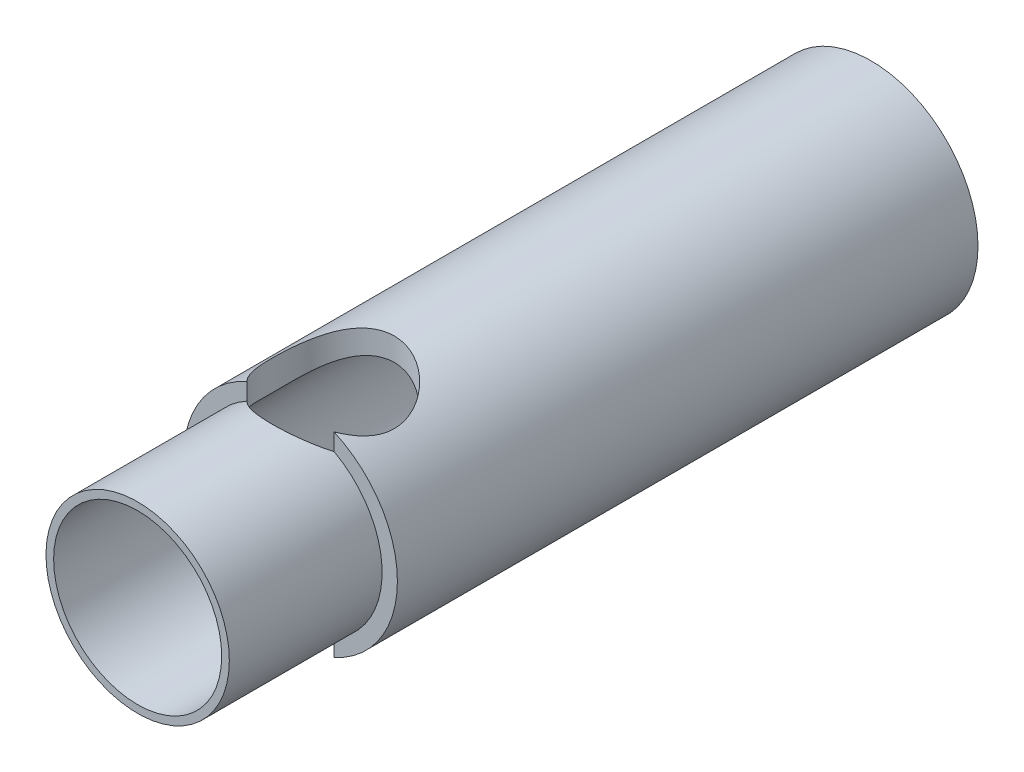
ISO-10303-21;
HEADER;
FILE_DESCRIPTION(('STEP AP214'),'2;1');
FILE_NAME('part.step','',(''),(''),'','','');
FILE_SCHEMA(('AUTOMOTIVE_DESIGN { 1 0 10303 214 1 1 1 1 }'));
ENDSEC;
DATA;
#1=APPLICATION_CONTEXT('core data for automotive mechanical design processes');
#2=APPLICATION_PROTOCOL_DEFINITION('international standard','automotive_design',2000,#1);
#3=PRODUCT_CONTEXT('',#1,'mechanical');
#4=PRODUCT('Part','Part','',(#3));
#5=PRODUCT_RELATED_PRODUCT_CATEGORY('part','',(#4));
#6=PRODUCT_DEFINITION_FORMATION('','',#4);
#7=PRODUCT_DEFINITION_CONTEXT('part definition',#1,'design');
#8=PRODUCT_DEFINITION('design','',#6,#7);
#9=PRODUCT_DEFINITION_SHAPE('','',#8);
#10=(LENGTH_UNIT() NAMED_UNIT(*) SI_UNIT(.MILLI.,.METRE.));
#11=(NAMED_UNIT(*) PLANE_ANGLE_UNIT() SI_UNIT($,.RADIAN.));
#12=(NAMED_UNIT(*) SI_UNIT($,.STERADIAN.) SOLID_ANGLE_UNIT());
#13=UNCERTAINTY_MEASURE_WITH_UNIT(LENGTH_MEASURE(1.E-05),#10,'distance_accuracy_value','');
#14=(GEOMETRIC_REPRESENTATION_CONTEXT(3) GLOBAL_UNCERTAINTY_ASSIGNED_CONTEXT((#13)) GLOBAL_UNIT_ASSIGNED_CONTEXT((#10,
#11,#12)) REPRESENTATION_CONTEXT('',''));
#15=CARTESIAN_POINT('',(0.,0.,0.));
#16=DIRECTION('',(0.,0.,1.));
#17=DIRECTION('',(1.,0.,0.));
#18=AXIS2_PLACEMENT_3D('',#15,#16,#17);
#19=CARTESIAN_POINT('',(0.,0.,19.));
#20=DIRECTION('',(0.,0.,1.));
#21=DIRECTION('',(1.,0.,0.));
#22=AXIS2_PLACEMENT_3D('',#19,#20,#21);
#23=PLANE('',#22);
#24=DIRECTION('',(0.,1.,0.));
#25=VECTOR('',#24,1.);
#26=CARTESIAN_POINT('',(1.42828568570857,-3.5,19.));
#27=LINE('',#26,#25);
#28=CARTESIAN_POINT('',(1.42828568570857,-3.19530906173409,19.));
#29=VERTEX_POINT('',#28);
#30=CARTESIAN_POINT('',(1.42828568570857,-2.63818119165458,19.));
#31=VERTEX_POINT('',#30);
#32=EDGE_CURVE('E39',#29,#31,#27,.T.);
#33=ORIENTED_EDGE('',*,*,#32,.F.);
#34=CARTESIAN_POINT('',(0.,0.,19.));
#35=DIRECTION('',(0.,0.,1.));
#36=DIRECTION('',(1.,0.,0.));
#37=AXIS2_PLACEMENT_3D('',#34,#35,#36);
#38=CIRCLE('',#37,3.5);
#39=CARTESIAN_POINT('',(1.42828568570857,3.19530906173409,19.));
#40=VERTEX_POINT('',#39);
#41=EDGE_CURVE('E129',#29,#40,#38,.T.);
#42=ORIENTED_EDGE('',*,*,#41,.T.);
#43=CARTESIAN_POINT('',(1.42828568570857,2.63818119165458,19.));
#44=VERTEX_POINT('',#43);
#45=EDGE_CURVE('E120',#44,#40,#27,.T.);
#46=ORIENTED_EDGE('',*,*,#45,.F.);
#47=CARTESIAN_POINT('',(0.,0.,19.));
#48=DIRECTION('',(0.,0.,1.));
#49=DIRECTION('',(1.,0.,0.));
#50=AXIS2_PLACEMENT_3D('',#47,#48,#49);
#51=CIRCLE('',#50,3.);
#52=EDGE_CURVE('E31',#31,#44,#51,.T.);
#53=ORIENTED_EDGE('',*,*,#52,.F.);
#54=EDGE_LOOP('',(#33,#42,#46,#53));
#55=FACE_BOUND('',#54,.T.);
#56=ADVANCED_FACE('F16',(#55),#23,.T.);
#57=CARTESIAN_POINT('',(0.,0.,4.));
#58=DIRECTION('',(0.,0.,-1.));
#59=DIRECTION('',(-1.,0.,0.));
#60=AXIS2_PLACEMENT_3D('',#57,#58,#59);
#61=PLANE('',#60);
#62=CARTESIAN_POINT('',(0.,0.,4.));
#63=DIRECTION('',(0.,0.,-1.));
#64=DIRECTION('',(-1.,0.,0.));
#65=AXIS2_PLACEMENT_3D('',#62,#63,#64);
#66=CIRCLE('',#65,2.75);
#67=CARTESIAN_POINT('',(-2.38156986040721,1.375,4.));
#68=VERTEX_POINT('',#67);
#69=CARTESIAN_POINT('',(0.,2.75,4.));
#70=VERTEX_POINT('',#69);
#71=EDGE_CURVE('E321',#68,#70,#66,.T.);
#72=ORIENTED_EDGE('',*,*,#71,.F.);
#73=DIRECTION('',(0.5,0.866025403784439,0.));
#74=VECTOR('',#73,1.);
#75=CARTESIAN_POINT('',(-3.17542648054294,0.,4.));
#76=LINE('',#75,#74);
#77=CARTESIAN_POINT('',(-1.58771324027147,2.75,4.));
#78=VERTEX_POINT('',#77);
#79=EDGE_CURVE('E269',#68,#78,#76,.T.);
#80=ORIENTED_EDGE('',*,*,#79,.T.);
#81=DIRECTION('',(1.,0.,0.));
#82=VECTOR('',#81,1.);
#83=CARTESIAN_POINT('',(-1.58771324027147,2.75,4.));
#84=LINE('',#83,#82);
#85=EDGE_CURVE('E274',#78,#70,#84,.T.);
#86=ORIENTED_EDGE('',*,*,#85,.T.);
#87=EDGE_LOOP('',(#72,#80,#86));
#88=FACE_BOUND('',#87,.T.);
#89=ADVANCED_FACE('F204',(#88),#61,.T.);
#90=CARTESIAN_POINT('',(2.38156986040721,1.375,4.));
#91=VERTEX_POINT('',#90);
#92=EDGE_CURVE('E322',#70,#91,#66,.T.);
#93=ORIENTED_EDGE('',*,*,#92,.F.);
#94=CARTESIAN_POINT('',(1.58771324027147,2.75,4.));
#95=VERTEX_POINT('',#94);
#96=EDGE_CURVE('E273',#70,#95,#84,.T.);
#97=ORIENTED_EDGE('',*,*,#96,.T.);
#98=DIRECTION('',(0.5,-0.866025403784439,0.));
#99=VECTOR('',#98,1.);
#100=CARTESIAN_POINT('',(1.58771324027147,2.75,4.));
#101=LINE('',#100,#99);
#102=EDGE_CURVE('E315',#95,#91,#101,.T.);
#103=ORIENTED_EDGE('',*,*,#102,.T.);
#104=EDGE_LOOP('',(#93,#97,#103));
#105=FACE_BOUND('',#104,.T.);
#106=ADVANCED_FACE('F208',(#105),#61,.T.);
#107=CARTESIAN_POINT('',(2.38156986040721,-1.375,4.));
#108=VERTEX_POINT('',#107);
#109=EDGE_CURVE('E318',#91,#108,#66,.T.);
#110=ORIENTED_EDGE('',*,*,#109,.F.);
#111=CARTESIAN_POINT('',(3.17542648054294,0.,4.));
#112=VERTEX_POINT('',#111);
#113=EDGE_CURVE('E295',#91,#112,#101,.T.);
#114=ORIENTED_EDGE('',*,*,#113,.T.);
#115=DIRECTION('',(-0.5,-0.866025403784439,0.));
#116=VECTOR('',#115,1.);
#117=CARTESIAN_POINT('',(3.17542648054294,0.,4.));
#118=LINE('',#117,#116);
#119=EDGE_CURVE('E258',#112,#108,#118,.T.);
#120=ORIENTED_EDGE('',*,*,#119,.T.);
#121=EDGE_LOOP('',(#110,#114,#120));
#122=FACE_BOUND('',#121,.T.);
#123=ADVANCED_FACE('F214',(#122),#61,.T.);
#124=CARTESIAN_POINT('',(0.,-2.75,4.));
#125=VERTEX_POINT('',#124);
#126=EDGE_CURVE('E249',#108,#125,#66,.T.);
#127=ORIENTED_EDGE('',*,*,#126,.F.);
#128=CARTESIAN_POINT('',(1.58771324027147,-2.75,4.));
#129=VERTEX_POINT('',#128);
#130=EDGE_CURVE('E262',#108,#129,#118,.T.);
#131=ORIENTED_EDGE('',*,*,#130,.T.);
#132=DIRECTION('',(-1.,0.,0.));
#133=VECTOR('',#132,1.);
#134=CARTESIAN_POINT('',(1.58771324027147,-2.75,4.));
#135=LINE('',#134,#133);
#136=EDGE_CURVE('E256',#129,#125,#135,.T.);
#137=ORIENTED_EDGE('',*,*,#136,.T.);
#138=EDGE_LOOP('',(#127,#131,#137));
#139=FACE_BOUND('',#138,.T.);
#140=ADVANCED_FACE('F232',(#139),#61,.T.);
#141=CARTESIAN_POINT('',(-2.38156986040721,-1.375,4.));
#142=VERTEX_POINT('',#141);
#143=EDGE_CURVE('E242',#125,#142,#66,.T.);
#144=ORIENTED_EDGE('',*,*,#143,.F.);
#145=CARTESIAN_POINT('',(-1.58771324027147,-2.75,4.));
#146=VERTEX_POINT('',#145);
#147=EDGE_CURVE('E244',#125,#146,#135,.T.);
#148=ORIENTED_EDGE('',*,*,#147,.T.);
#149=DIRECTION('',(-0.5,0.866025403784439,0.));
#150=VECTOR('',#149,1.);
#151=CARTESIAN_POINT('',(-1.58771324027147,-2.75,4.));
#152=LINE('',#151,#150);
#153=EDGE_CURVE('E247',#146,#142,#152,.T.);
#154=ORIENTED_EDGE('',*,*,#153,.T.);
#155=EDGE_LOOP('',(#144,#148,#154));
#156=FACE_BOUND('',#155,.T.);
#157=ADVANCED_FACE('F221',(#156),#61,.T.);
#158=CARTESIAN_POINT('',(0.,0.,19.));
#159=DIRECTION('',(0.,0.,-1.));
#160=DIRECTION('',(-1.,0.,0.));
#161=AXIS2_PLACEMENT_3D('',#158,#159,#160);
#162=CYLINDRICAL_SURFACE('',#161,3.5);
#163=CARTESIAN_POINT('',(-1.42828568570857,3.19530906173409,19.));
#164=VERTEX_POINT('',#163);
#165=CARTESIAN_POINT('',(-1.42828568570857,-3.19530906173409,19.));
#166=VERTEX_POINT('',#165);
#167=EDGE_CURVE('E134',#164,#166,#38,.T.);
#168=ORIENTED_EDGE('',*,*,#167,.F.);
#169=CARTESIAN_POINT('',(-1.42828568570857,3.19530906173409,19.));
#170=CARTESIAN_POINT('',(-1.50540075099643,3.16088219235599,18.9212899360863));
#171=CARTESIAN_POINT('',(-1.57602687440512,3.12591402054111,18.8362557376562));
#172=CARTESIAN_POINT('',(-1.70328088219409,3.05843234688911,18.6541901318598));
#173=CARTESIAN_POINT('',(-1.75977642340309,3.02594389846291,18.5570572000863));
#174=CARTESIAN_POINT('',(-1.85649150133034,2.96760317884196,18.3525059916485));
#175=CARTESIAN_POINT('',(-1.89664389660993,2.94177843949423,18.2450474840408));
#176=CARTESIAN_POINT('',(-1.95806267846864,2.9012718661427,18.0232398700548));
#177=CARTESIAN_POINT('',(-1.97941439999871,2.88653972822981,17.9089244403634));
#178=CARTESIAN_POINT('',(-2.00049949160929,2.87195745617673,17.6916858385504));
#179=CARTESIAN_POINT('',(-2.0025751082838,2.87049543971656,17.589097274272));
#180=CARTESIAN_POINT('',(-1.99105032466949,2.878500637721,17.3851685869099));
#181=CARTESIAN_POINT('',(-1.97743821917266,2.88797601299917,17.2838294531264));
#182=CARTESIAN_POINT('',(-1.9372397850846,2.91506675548669,17.0943619692331));
#183=CARTESIAN_POINT('',(-1.91188366547716,2.93190323133123,17.0058508629221));
#184=CARTESIAN_POINT('',(-1.84987418158541,2.97141599701883,16.8343043289516));
#185=CARTESIAN_POINT('',(-1.81321892230411,2.99409326632582,16.7512698226193));
#186=CARTESIAN_POINT('',(-1.72411381616276,3.04637986157905,16.5812671627577));
#187=CARTESIAN_POINT('',(-1.67022092674974,3.0765085972055,16.4952173151997));
#188=CARTESIAN_POINT('',(-1.55044597548239,3.13857826599021,16.3325886107996));
#189=CARTESIAN_POINT('',(-1.48455368209843,3.17052072953958,16.2560179308775));
#190=CARTESIAN_POINT('',(-1.33116446713628,3.23821254238362,16.1028637841158));
#191=CARTESIAN_POINT('',(-1.24191284281847,3.27382422477775,16.0279613138386));
#192=CARTESIAN_POINT('',(-1.05049527278557,3.34016587520829,15.8941025924676));
#193=CARTESIAN_POINT('',(-0.948330663057441,3.3708963475171,15.8351446937151));
#194=CARTESIAN_POINT('',(-0.736136215932795,3.4234086325735,15.7368281129788));
#195=CARTESIAN_POINT('',(-0.626377143751666,3.4454007742097,15.6970032207837));
#196=CARTESIAN_POINT('',(-0.400133986017147,3.47892410517635,15.6369555224841));
#197=CARTESIAN_POINT('',(-0.283658246177626,3.49046799114165,15.6167089229457));
#198=CARTESIAN_POINT('',(-0.0634756279869164,3.50093500652055,15.5983544451567));
#199=CARTESIAN_POINT('',(0.0399620941799944,3.50128174850157,15.5977492835162));
#200=CARTESIAN_POINT('',(0.245317216555775,3.49290267271402,15.6124367211845));
#201=CARTESIAN_POINT('',(0.347234826363394,3.48417811768217,15.6277271078115));
#202=CARTESIAN_POINT('',(0.541933044290401,3.4591207883811,15.6723496857516));
#203=CARTESIAN_POINT('',(0.6349183573146,3.44315403218992,15.7010080466811));
#204=CARTESIAN_POINT('',(0.814671537645636,3.40510772827646,15.7708973811678));
#205=CARTESIAN_POINT('',(0.901438324431149,3.38302712144718,15.8121305331913));
#206=CARTESIAN_POINT('',(1.07408031056902,3.33243092782974,15.9097395015168));
#207=CARTESIAN_POINT('',(1.15929571756628,3.30353553741324,15.9670815684401));
#208=CARTESIAN_POINT('',(1.31943841016314,3.24290449907532,16.0935112981239));
#209=CARTESIAN_POINT('',(1.39435598338631,3.21116621584451,16.1626099134789));
#210=CARTESIAN_POINT('',(1.54144081109961,3.14345298771101,16.3205431493815));
#211=CARTESIAN_POINT('',(1.61211040714192,3.10744150402796,16.4107631416315));
#212=CARTESIAN_POINT('',(1.73752559142288,3.03909725279354,16.6029297670978));
#213=CARTESIAN_POINT('',(1.79227977495783,3.00676250534589,16.7048700289812));
#214=CARTESIAN_POINT('',(1.87624309014316,2.95495012966174,16.9006638359873));
#215=CARTESIAN_POINT('',(1.90819661642942,2.93422562195949,16.9930053285875));
#216=CARTESIAN_POINT('',(1.9584364867525,2.90093919380007,17.1827151683584));
#217=CARTESIAN_POINT('',(1.97673923709188,2.88836747722102,17.2800773303658));
#218=CARTESIAN_POINT('',(1.99874204321677,2.87319036043596,17.4777137539879));
#219=CARTESIAN_POINT('',(2.00237316416221,2.87063200991594,17.5779995379321));
#220=CARTESIAN_POINT('',(1.99459620906295,2.87603970770297,17.7776790711712));
#221=CARTESIAN_POINT('',(1.98318922714383,2.8840049903433,17.8770728848334));
#222=CARTESIAN_POINT('',(1.94735235183452,2.90830441512838,18.065144562592));
#223=CARTESIAN_POINT('',(1.92387192897381,2.92402540088592,18.1540893107039));
#224=CARTESIAN_POINT('',(1.86547084061028,2.96162506324936,18.3268796250716));
#225=CARTESIAN_POINT('',(1.83053053918116,2.98351429971253,18.4107161441941));
#226=CARTESIAN_POINT('',(1.74330319278334,3.03543675238782,18.5859360069279));
#227=CARTESIAN_POINT('',(1.68906135579018,3.06622370341073,18.6761177097515));
#228=CARTESIAN_POINT('',(1.56786092378043,3.12994099360824,18.8460488701752));
#229=CARTESIAN_POINT('',(1.5009558214801,3.16286194684341,18.9258399095379));
#230=CARTESIAN_POINT('',(1.42828568570858,3.19530906173409,19.));
#231=B_SPLINE_CURVE_WITH_KNOTS('',3,(#169,#170,#171,#172,#173,#174,#175,#176,#177,#178,#179,
#180,#181,#182,#183,#184,#185,#186,#187,#188,#189,#190,#191,#192,#193,#194,#195,#196,#197,#198,
#199,#200,#201,#202,#203,#204,#205,#206,#207,#208,#209,#210,#211,#212,#213,#214,#215,#216,#217,
#218,#219,#220,#221,#222,#223,#224,#225,#226,#227,#228,#229,#230),.UNSPECIFIED.,.F.,.F.,(4,2,2,
2,2,2,2,2,2,2,2,2,2,2,2,2,2,2,2,2,2,2,2,2,2,2,2,2,2,2,4),(0.,0.346213819330013,
0.695558032847954,1.04632328947067,1.39548811587963,1.70157290849816,2.00788623059734,
2.28758180990387,2.56732432295289,2.88384871287554,3.20064426816473,3.56440500234285,
3.92812813232727,4.2824717053999,4.63638410266836,4.94509488146347,5.25376269305672,
5.54832066534372,5.84292969609173,6.16176014847242,6.48088927144811,6.83966046648897,
7.1982375415979,7.49666339586378,7.79473000391131,8.09419546457953,8.39363913827486,
8.6724913485849,8.95182387630175,9.27945616936722,9.60573416372487),.UNSPECIFIED.);
#232=EDGE_CURVE('E130',#164,#40,#231,.T.);
#233=ORIENTED_EDGE('',*,*,#232,.T.);
#234=ORIENTED_EDGE('',*,*,#41,.F.);
#235=CARTESIAN_POINT('',(1.42828568570857,-3.19530906173409,19.));
#236=CARTESIAN_POINT('',(1.50540075099643,-3.16088219235599,18.9212899360863));
#237=CARTESIAN_POINT('',(1.57602687440512,-3.12591402054111,18.8362557376562));
#238=CARTESIAN_POINT('',(1.70328088219409,-3.05843234688911,18.6541901318598));
#239=CARTESIAN_POINT('',(1.75977642340309,-3.02594389846291,18.5570572000863));
#240=CARTESIAN_POINT('',(1.85649150133034,-2.96760317884196,18.3525059916485));
#241=CARTESIAN_POINT('',(1.89664389660993,-2.94177843949423,18.2450474840408));
#242=CARTESIAN_POINT('',(1.95806267846864,-2.9012718661427,18.0232398700548));
#243=CARTESIAN_POINT('',(1.97941439999871,-2.88653972822981,17.9089244403634));
#244=CARTESIAN_POINT('',(2.00049949160929,-2.87195745617673,17.6916858385504));
#245=CARTESIAN_POINT('',(2.0025751082838,-2.87049543971656,17.589097274272));
#246=CARTESIAN_POINT('',(1.99105032466949,-2.878500637721,17.3851685869099));
#247=CARTESIAN_POINT('',(1.97743821917266,-2.88797601299917,17.2838294531264));
#248=CARTESIAN_POINT('',(1.9372397850846,-2.91506675548669,17.0943619692331));
#249=CARTESIAN_POINT('',(1.91188366547716,-2.93190323133123,17.0058508629221));
#250=CARTESIAN_POINT('',(1.84987418158541,-2.97141599701883,16.8343043289516));
#251=CARTESIAN_POINT('',(1.81321892230411,-2.99409326632582,16.7512698226193));
#252=CARTESIAN_POINT('',(1.72411381616276,-3.04637986157905,16.5812671627577));
#253=CARTESIAN_POINT('',(1.67022092674974,-3.0765085972055,16.4952173151997));
#254=CARTESIAN_POINT('',(1.55044597548239,-3.13857826599021,16.3325886107996));
#255=CARTESIAN_POINT('',(1.48455368209843,-3.17052072953958,16.2560179308775));
#256=CARTESIAN_POINT('',(1.33116446713628,-3.23821254238362,16.1028637841158));
#257=CARTESIAN_POINT('',(1.24191284281847,-3.27382422477775,16.0279613138386));
#258=CARTESIAN_POINT('',(1.05049527278557,-3.34016587520829,15.8941025924676));
#259=CARTESIAN_POINT('',(0.948330663057441,-3.3708963475171,15.8351446937151));
#260=CARTESIAN_POINT('',(0.736136215932795,-3.4234086325735,15.7368281129788));
#261=CARTESIAN_POINT('',(0.626377143751666,-3.4454007742097,15.6970032207837));
#262=CARTESIAN_POINT('',(0.400133986017147,-3.47892410517635,15.6369555224841));
#263=CARTESIAN_POINT('',(0.283658246177626,-3.49046799114165,15.6167089229457));
#264=CARTESIAN_POINT('',(0.0634756279869164,-3.50093500652055,15.5983544451567));
#265=CARTESIAN_POINT('',(-0.0399620941799944,-3.50128174850157,15.5977492835162));
#266=CARTESIAN_POINT('',(-0.245317216555775,-3.49290267271402,15.6124367211845));
#267=CARTESIAN_POINT('',(-0.347234826363394,-3.48417811768217,15.6277271078115));
#268=CARTESIAN_POINT('',(-0.541933044290401,-3.4591207883811,15.6723496857516));
#269=CARTESIAN_POINT('',(-0.6349183573146,-3.44315403218992,15.7010080466811));
#270=CARTESIAN_POINT('',(-0.814671537645636,-3.40510772827646,15.7708973811678));
#271=CARTESIAN_POINT('',(-0.901438324431149,-3.38302712144718,15.8121305331913));
#272=CARTESIAN_POINT('',(-1.07408031056902,-3.33243092782974,15.9097395015168));
#273=CARTESIAN_POINT('',(-1.15929571756628,-3.30353553741324,15.9670815684401));
#274=CARTESIAN_POINT('',(-1.31943841016314,-3.24290449907532,16.0935112981239));
#275=CARTESIAN_POINT('',(-1.39435598338631,-3.21116621584451,16.1626099134789));
#276=CARTESIAN_POINT('',(-1.54144081109961,-3.14345298771101,16.3205431493815));
#277=CARTESIAN_POINT('',(-1.61211040714192,-3.10744150402796,16.4107631416315));
#278=CARTESIAN_POINT('',(-1.73752559142288,-3.03909725279354,16.6029297670978));
#279=CARTESIAN_POINT('',(-1.79227977495783,-3.00676250534589,16.7048700289812));
#280=CARTESIAN_POINT('',(-1.87624309014316,-2.95495012966174,16.9006638359873));
#281=CARTESIAN_POINT('',(-1.90819661642942,-2.93422562195949,16.9930053285875));
#282=CARTESIAN_POINT('',(-1.9584364867525,-2.90093919380007,17.1827151683584));
#283=CARTESIAN_POINT('',(-1.97673923709188,-2.88836747722102,17.2800773303658));
#284=CARTESIAN_POINT('',(-1.99874204321677,-2.87319036043596,17.4777137539879));
#285=CARTESIAN_POINT('',(-2.00237316416221,-2.87063200991594,17.5779995379321));
#286=CARTESIAN_POINT('',(-1.99459620906295,-2.87603970770297,17.7776790711712));
#287=CARTESIAN_POINT('',(-1.98318922714383,-2.8840049903433,17.8770728848334));
#288=CARTESIAN_POINT('',(-1.94735235183452,-2.90830441512838,18.065144562592));
#289=CARTESIAN_POINT('',(-1.92387192897381,-2.92402540088592,18.1540893107039));
#290=CARTESIAN_POINT('',(-1.86547084061028,-2.96162506324936,18.3268796250716));
#291=CARTESIAN_POINT('',(-1.83053053918116,-2.98351429971253,18.4107161441941));
#292=CARTESIAN_POINT('',(-1.74330319278334,-3.03543675238782,18.5859360069279));
#293=CARTESIAN_POINT('',(-1.68906135579018,-3.06622370341073,18.6761177097515));
#294=CARTESIAN_POINT('',(-1.56786092378043,-3.12994099360824,18.8460488701752));
#295=CARTESIAN_POINT('',(-1.5009558214801,-3.16286194684341,18.9258399095379));
#296=CARTESIAN_POINT('',(-1.42828568570858,-3.19530906173409,19.));
#297=B_SPLINE_CURVE_WITH_KNOTS('',3,(#235,#236,#237,#238,#239,#240,#241,#242,#243,#244,#245,
#246,#247,#248,#249,#250,#251,#252,#253,#254,#255,#256,#257,#258,#259,#260,#261,#262,#263,#264,
#265,#266,#267,#268,#269,#270,#271,#272,#273,#274,#275,#276,#277,#278,#279,#280,#281,#282,#283,
#284,#285,#286,#287,#288,#289,#290,#291,#292,#293,#294,#295,#296),.UNSPECIFIED.,.F.,.F.,(4,2,2,
2,2,2,2,2,2,2,2,2,2,2,2,2,2,2,2,2,2,2,2,2,2,2,2,2,2,2,4),(0.,0.346213819330013,
0.695558032847954,1.04632328947067,1.39548811587963,1.70157290849816,2.00788623059734,
2.28758180990387,2.56732432295289,2.88384871287554,3.20064426816473,3.56440500234285,
3.92812813232727,4.2824717053999,4.63638410266836,4.94509488146347,5.25376269305672,
5.54832066534372,5.84292969609173,6.16176014847242,6.48088927144811,6.83966046648897,
7.1982375415979,7.49666339586378,7.79473000391131,8.09419546457953,8.39363913827486,
8.6724913485849,8.95182387630175,9.27945616936722,9.60573416372487),.UNSPECIFIED.);
#298=EDGE_CURVE('E178',#29,#166,#297,.T.);
#299=ORIENTED_EDGE('',*,*,#298,.T.);
#300=EDGE_LOOP('',(#168,#233,#234,#299));
#301=FACE_BOUND('',#300,.T.);
#302=CARTESIAN_POINT('',(0.,0.,0.));
#303=DIRECTION('',(0.,0.,1.));
#304=DIRECTION('',(1.,0.,0.));
#305=AXIS2_PLACEMENT_3D('',#302,#303,#304);
#306=CIRCLE('',#305,3.5);
#307=CARTESIAN_POINT('',(3.5,0.,0.));
#308=VERTEX_POINT('',#307);
#309=EDGE_CURVE('E141',#308,#308,#306,.T.);
#310=ORIENTED_EDGE('',*,*,#309,.T.);
#311=EDGE_LOOP('',(#310));
#312=FACE_BOUND('',#311,.T.);
#313=ADVANCED_FACE('F18',(#301,#312),#162,.T.);
#314=DIRECTION('',(0.,1.,0.));
#315=VECTOR('',#314,1.);
#316=CARTESIAN_POINT('',(-1.42828568570857,-3.5,19.));
#317=LINE('',#316,#315);
#318=CARTESIAN_POINT('',(-1.42828568570857,2.63818119165458,19.));
#319=VERTEX_POINT('',#318);
#320=EDGE_CURVE('E47',#164,#319,#317,.F.);
#321=ORIENTED_EDGE('',*,*,#320,.F.);
#322=ORIENTED_EDGE('',*,*,#167,.T.);
#323=CARTESIAN_POINT('',(-1.42828568570857,-2.63818119165458,19.));
#324=VERTEX_POINT('',#323);
#325=EDGE_CURVE('E177',#324,#166,#317,.F.);
#326=ORIENTED_EDGE('',*,*,#325,.F.);
#327=EDGE_CURVE('E10',#319,#324,#51,.T.);
#328=ORIENTED_EDGE('',*,*,#327,.F.);
#329=EDGE_LOOP('',(#321,#322,#326,#328));
#330=FACE_BOUND('',#329,.T.);
#331=ADVANCED_FACE('F192',(#330),#23,.T.);
#332=CARTESIAN_POINT('',(0.,0.,0.));
#333=DIRECTION('',(0.,0.,1.));
#334=DIRECTION('',(1.,0.,0.));
#335=AXIS2_PLACEMENT_3D('',#332,#333,#334);
#336=PLANE('',#335);
#337=DIRECTION('',(-0.5,-0.866025403784439,0.));
#338=VECTOR('',#337,1.);
#339=CARTESIAN_POINT('',(3.17542648054294,0.,0.));
#340=LINE('',#339,#338);
#341=CARTESIAN_POINT('',(3.17542648054294,0.,0.));
#342=VERTEX_POINT('',#341);
#343=CARTESIAN_POINT('',(1.58771324027147,-2.75,0.));
#344=VERTEX_POINT('',#343);
#345=EDGE_CURVE('E280',#342,#344,#340,.T.);
#346=ORIENTED_EDGE('',*,*,#345,.F.);
#347=DIRECTION('',(0.5,-0.866025403784439,0.));
#348=VECTOR('',#347,1.);
#349=CARTESIAN_POINT('',(1.58771324027147,2.75,0.));
#350=LINE('',#349,#348);
#351=CARTESIAN_POINT('',(1.58771324027147,2.75,0.));
#352=VERTEX_POINT('',#351);
#353=EDGE_CURVE('E278',#352,#342,#350,.T.);
#354=ORIENTED_EDGE('',*,*,#353,.F.);
#355=DIRECTION('',(1.,0.,0.));
#356=VECTOR('',#355,1.);
#357=CARTESIAN_POINT('',(-1.58771324027147,2.75,0.));
#358=LINE('',#357,#356);
#359=CARTESIAN_POINT('',(-1.58771324027147,2.75,0.));
#360=VERTEX_POINT('',#359);
#361=EDGE_CURVE('E292',#360,#352,#358,.T.);
#362=ORIENTED_EDGE('',*,*,#361,.F.);
#363=DIRECTION('',(0.5,0.866025403784439,0.));
#364=VECTOR('',#363,1.);
#365=CARTESIAN_POINT('',(-3.17542648054294,0.,0.));
#366=LINE('',#365,#364);
#367=CARTESIAN_POINT('',(-3.17542648054294,0.,0.));
#368=VERTEX_POINT('',#367);
#369=EDGE_CURVE('E289',#368,#360,#366,.T.);
#370=ORIENTED_EDGE('',*,*,#369,.F.);
#371=DIRECTION('',(-0.5,0.866025403784439,0.));
#372=VECTOR('',#371,1.);
#373=CARTESIAN_POINT('',(-1.58771324027147,-2.75,0.));
#374=LINE('',#373,#372);
#375=CARTESIAN_POINT('',(-1.58771324027147,-2.75,0.));
#376=VERTEX_POINT('',#375);
#377=EDGE_CURVE('E286',#376,#368,#374,.T.);
#378=ORIENTED_EDGE('',*,*,#377,.F.);
#379=DIRECTION('',(-1.,0.,0.));
#380=VECTOR('',#379,1.);
#381=CARTESIAN_POINT('',(1.58771324027147,-2.75,0.));
#382=LINE('',#381,#380);
#383=EDGE_CURVE('E284',#344,#376,#382,.T.);
#384=ORIENTED_EDGE('',*,*,#383,.F.);
#385=EDGE_LOOP('',(#346,#354,#362,#370,#378,#384));
#386=FACE_BOUND('',#385,.T.);
#387=ORIENTED_EDGE('',*,*,#309,.F.);
#388=EDGE_LOOP('',(#387));
#389=FACE_BOUND('',#388,.T.);
#390=ADVANCED_FACE('F189',(#386,#389),#336,.F.);
#391=CARTESIAN_POINT('',(0.,0.,24.));
#392=DIRECTION('',(0.,0.,-1.));
#393=DIRECTION('',(-1.,0.,0.));
#394=AXIS2_PLACEMENT_3D('',#391,#392,#393);
#395=CYLINDRICAL_SURFACE('',#394,3.);
#396=CARTESIAN_POINT('',(0.,0.,24.));
#397=DIRECTION('',(0.,0.,1.));
#398=DIRECTION('',(1.,0.,0.));
#399=AXIS2_PLACEMENT_3D('',#396,#397,#398);
#400=CIRCLE('',#399,3.);
#401=CARTESIAN_POINT('',(3.,0.,24.));
#402=VERTEX_POINT('',#401);
#403=EDGE_CURVE('E138',#402,#402,#400,.T.);
#404=ORIENTED_EDGE('',*,*,#403,.F.);
#405=EDGE_LOOP('',(#404));
#406=FACE_BOUND('',#405,.T.);
#407=ORIENTED_EDGE('',*,*,#327,.T.);
#408=CARTESIAN_POINT('',(-1.42828568570857,-2.63818119165458,19.));
#409=CARTESIAN_POINT('',(-1.3907413524686,-2.65850749072931,19.0382921075495));
#410=CARTESIAN_POINT('',(-1.35163083583844,-2.67864388925991,19.0751206269779));
#411=CARTESIAN_POINT('',(-1.27031632987792,-2.7181508136518,19.1457059281426));
#412=CARTESIAN_POINT('',(-1.22811016011213,-2.73752078460274,19.1794605064871));
#413=CARTESIAN_POINT('',(-1.09640519568439,-2.79410904495822,19.2762472512302));
#414=CARTESIAN_POINT('',(-1.00232432904014,-2.82952259164571,19.3342846767945));
#415=CARTESIAN_POINT('',(-0.803174881769032,-2.89238031177622,19.4350531965054));
#416=CARTESIAN_POINT('',(-0.698055415905299,-2.91978515925093,19.4777089923526));
#417=CARTESIAN_POINT('',(-0.480261199644424,-2.96337474699157,19.5447994037482));
#418=CARTESIAN_POINT('',(-0.367616624914446,-2.97960165894309,19.5693025316966));
#419=CARTESIAN_POINT('',(-0.152497469465144,-2.99782810911677,19.5967622750591));
#420=CARTESIAN_POINT('',(-0.0504307953736704,-3.00130506653291,19.6019573909872));
#421=CARTESIAN_POINT('',(0.1531711465426,-2.99781523671771,19.5967229431407));
#422=CARTESIAN_POINT('',(0.254706215857077,-2.99084479349064,19.5862879097042));
#423=CARTESIAN_POINT('',(0.446214935347636,-2.96807830948802,19.5518292242866));
#424=CARTESIAN_POINT('',(0.536478561833825,-2.95299887497794,19.528907175953));
#425=CARTESIAN_POINT('',(0.711651328081675,-2.91574645789069,19.4713785740917));
#426=CARTESIAN_POINT('',(0.79655824585138,-2.89357055452042,19.4367672091026));
#427=CARTESIAN_POINT('',(0.966123246613496,-2.8416715964457,19.3539164066266));
#428=CARTESIAN_POINT('',(1.05020735106611,-2.81148363926429,19.3048020472405));
#429=CARTESIAN_POINT('',(1.20921482809013,-2.7468444753136,19.1959571706696));
#430=CARTESIAN_POINT('',(1.28414680798203,-2.71239733652141,19.136236759973));
#431=CARTESIAN_POINT('',(1.37952051840106,-2.66415828133607,19.0484850666802));
#432=CARTESIAN_POINT('',(1.40423479878438,-2.65120508393456,19.0245358793902));
#433=CARTESIAN_POINT('',(1.42828568570858,-2.63818119165458,19.));
#434=B_SPLINE_CURVE_WITH_KNOTS('',3,(#408,#409,#410,#411,#412,#413,#414,#415,#416,#417,#418,
#419,#420,#421,#422,#423,#424,#425,#426,#427,#428,#429,#430,#431,#432,#433),.UNSPECIFIED.,.F.,
.F.,(4,2,2,2,2,2,2,2,2,2,2,2,4),(0.,0.171965694881922,0.344053699688785,0.690532991103906,
1.03868610000375,1.38551840844654,1.6906031530492,1.99579468488208,2.27761884879716,
2.55955915654239,2.86427107645294,3.16869417978828,3.27895742787516),.UNSPECIFIED.);
#435=EDGE_CURVE('E133',#324,#31,#434,.T.);
#436=ORIENTED_EDGE('',*,*,#435,.T.);
#437=ORIENTED_EDGE('',*,*,#52,.T.);
#438=CARTESIAN_POINT('',(1.42828568570857,2.63818119165458,19.));
#439=CARTESIAN_POINT('',(1.3907413524686,2.65850749072931,19.0382921075495));
#440=CARTESIAN_POINT('',(1.35163083583844,2.67864388925991,19.0751206269779));
#441=CARTESIAN_POINT('',(1.27031632987792,2.7181508136518,19.1457059281426));
#442=CARTESIAN_POINT('',(1.22811016011213,2.73752078460274,19.1794605064871));
#443=CARTESIAN_POINT('',(1.09640519568439,2.79410904495822,19.2762472512302));
#444=CARTESIAN_POINT('',(1.00232432904014,2.82952259164571,19.3342846767945));
#445=CARTESIAN_POINT('',(0.803174881769032,2.89238031177622,19.4350531965054));
#446=CARTESIAN_POINT('',(0.698055415905299,2.91978515925093,19.4777089923526));
#447=CARTESIAN_POINT('',(0.480261199644424,2.96337474699157,19.5447994037482));
#448=CARTESIAN_POINT('',(0.367616624914446,2.97960165894309,19.5693025316966));
#449=CARTESIAN_POINT('',(0.152497469465144,2.99782810911677,19.5967622750591));
#450=CARTESIAN_POINT('',(0.0504307953736704,3.00130506653291,19.6019573909872));
#451=CARTESIAN_POINT('',(-0.1531711465426,2.99781523671771,19.5967229431407));
#452=CARTESIAN_POINT('',(-0.254706215857077,2.99084479349064,19.5862879097042));
#453=CARTESIAN_POINT('',(-0.446214935347636,2.96807830948802,19.5518292242866));
#454=CARTESIAN_POINT('',(-0.536478561833825,2.95299887497794,19.528907175953));
#455=CARTESIAN_POINT('',(-0.711651328081675,2.91574645789069,19.4713785740917));
#456=CARTESIAN_POINT('',(-0.79655824585138,2.89357055452042,19.4367672091026));
#457=CARTESIAN_POINT('',(-0.966123246613496,2.8416715964457,19.3539164066266));
#458=CARTESIAN_POINT('',(-1.05020735106611,2.81148363926429,19.3048020472405));
#459=CARTESIAN_POINT('',(-1.20921482809013,2.7468444753136,19.1959571706696));
#460=CARTESIAN_POINT('',(-1.28414680798203,2.71239733652141,19.136236759973));
#461=CARTESIAN_POINT('',(-1.37952051840106,2.66415828133607,19.0484850666802));
#462=CARTESIAN_POINT('',(-1.40423479878438,2.65120508393456,19.0245358793902));
#463=CARTESIAN_POINT('',(-1.42828568570858,2.63818119165458,19.));
#464=B_SPLINE_CURVE_WITH_KNOTS('',3,(#438,#439,#440,#441,#442,#443,#444,#445,#446,#447,#448,
#449,#450,#451,#452,#453,#454,#455,#456,#457,#458,#459,#460,#461,#462,#463),.UNSPECIFIED.,.F.,
.F.,(4,2,2,2,2,2,2,2,2,2,2,2,4),(0.,0.171965694881922,0.344053699688785,0.690532991103906,
1.03868610000375,1.38551840844654,1.6906031530492,1.99579468488208,2.27761884879716,
2.55955915654239,2.86427107645294,3.16869417978828,3.27895742787516),.UNSPECIFIED.);
#465=EDGE_CURVE('E117',#44,#319,#464,.T.);
#466=ORIENTED_EDGE('',*,*,#465,.T.);
#467=EDGE_LOOP('',(#407,#436,#437,#466));
#468=FACE_BOUND('',#467,.T.);
#469=ADVANCED_FACE('F132',(#406,#468),#395,.T.);
#470=CARTESIAN_POINT('',(0.,0.,24.));
#471=DIRECTION('',(0.,0.,1.));
#472=DIRECTION('',(1.,0.,0.));
#473=AXIS2_PLACEMENT_3D('',#470,#471,#472);
#474=PLANE('',#473);
#475=CARTESIAN_POINT('',(0.,0.,24.));
#476=DIRECTION('',(0.,0.,-1.));
#477=DIRECTION('',(-1.,0.,0.));
#478=AXIS2_PLACEMENT_3D('',#475,#476,#477);
#479=CIRCLE('',#478,2.75);
#480=CARTESIAN_POINT('',(-2.75,0.,24.));
#481=VERTEX_POINT('',#480);
#482=EDGE_CURVE('E281',#481,#481,#479,.T.);
#483=ORIENTED_EDGE('',*,*,#482,.T.);
#484=EDGE_LOOP('',(#483));
#485=FACE_BOUND('',#484,.T.);
#486=ORIENTED_EDGE('',*,*,#403,.T.);
#487=EDGE_LOOP('',(#486));
#488=FACE_BOUND('',#487,.T.);
#489=ADVANCED_FACE('F188',(#485,#488),#474,.T.);
#490=CARTESIAN_POINT('',(1.58771324027147,2.75,4.));
#491=DIRECTION('',(0.866025403784439,0.5,0.));
#492=DIRECTION('',(-0.5,0.866025403784439,0.));
#493=AXIS2_PLACEMENT_3D('',#490,#491,#492);
#494=PLANE('',#493);
#495=ORIENTED_EDGE('',*,*,#353,.T.);
#496=DIRECTION('',(0.,0.,-1.));
#497=VECTOR('',#496,1.);
#498=CARTESIAN_POINT('',(3.17542648054294,0.,4.));
#499=LINE('',#498,#497);
#500=EDGE_CURVE('E277',#112,#342,#499,.T.);
#501=ORIENTED_EDGE('',*,*,#500,.F.);
#502=ORIENTED_EDGE('',*,*,#113,.F.);
#503=ORIENTED_EDGE('',*,*,#102,.F.);
#504=DIRECTION('',(0.,0.,-1.));
#505=VECTOR('',#504,1.);
#506=CARTESIAN_POINT('',(1.58771324027147,2.75,4.));
#507=LINE('',#506,#505);
#508=EDGE_CURVE('E296',#95,#352,#507,.T.);
#509=ORIENTED_EDGE('',*,*,#508,.T.);
#510=EDGE_LOOP('',(#495,#501,#502,#503,#509));
#511=FACE_BOUND('',#510,.T.);
#512=ADVANCED_FACE('F356',(#511),#494,.F.);
#513=CARTESIAN_POINT('',(-1.58771324027147,2.75,4.));
#514=DIRECTION('',(0.,1.,0.));
#515=DIRECTION('',(-1.,0.,0.));
#516=AXIS2_PLACEMENT_3D('',#513,#514,#515);
#517=PLANE('',#516);
#518=ORIENTED_EDGE('',*,*,#361,.T.);
#519=ORIENTED_EDGE('',*,*,#508,.F.);
#520=ORIENTED_EDGE('',*,*,#96,.F.);
#521=ORIENTED_EDGE('',*,*,#85,.F.);
#522=DIRECTION('',(0.,0.,-1.));
#523=VECTOR('',#522,1.);
#524=CARTESIAN_POINT('',(-1.58771324027147,2.75,4.));
#525=LINE('',#524,#523);
#526=EDGE_CURVE('E298',#78,#360,#525,.T.);
#527=ORIENTED_EDGE('',*,*,#526,.T.);
#528=EDGE_LOOP('',(#518,#519,#520,#521,#527));
#529=FACE_BOUND('',#528,.T.);
#530=ADVANCED_FACE('F334',(#529),#517,.F.);
#531=CARTESIAN_POINT('',(-3.17542648054294,0.,4.));
#532=DIRECTION('',(-0.866025403784439,0.5,0.));
#533=DIRECTION('',(-0.5,-0.866025403784439,0.));
#534=AXIS2_PLACEMENT_3D('',#531,#532,#533);
#535=PLANE('',#534);
#536=ORIENTED_EDGE('',*,*,#369,.T.);
#537=ORIENTED_EDGE('',*,*,#526,.F.);
#538=ORIENTED_EDGE('',*,*,#79,.F.);
#539=CARTESIAN_POINT('',(-3.17542648054294,0.,4.));
#540=VERTEX_POINT('',#539);
#541=EDGE_CURVE('E270',#540,#68,#76,.T.);
#542=ORIENTED_EDGE('',*,*,#541,.F.);
#543=DIRECTION('',(0.,0.,-1.));
#544=VECTOR('',#543,1.);
#545=CARTESIAN_POINT('',(-3.17542648054294,0.,4.));
#546=LINE('',#545,#544);
#547=EDGE_CURVE('E300',#540,#368,#546,.T.);
#548=ORIENTED_EDGE('',*,*,#547,.T.);
#549=EDGE_LOOP('',(#536,#537,#538,#542,#548));
#550=FACE_BOUND('',#549,.T.);
#551=ADVANCED_FACE('F338',(#550),#535,.F.);
#552=CARTESIAN_POINT('',(-1.58771324027147,-2.75,4.));
#553=DIRECTION('',(-0.866025403784439,-0.5,0.));
#554=DIRECTION('',(0.5,-0.866025403784439,0.));
#555=AXIS2_PLACEMENT_3D('',#552,#553,#554);
#556=PLANE('',#555);
#557=ORIENTED_EDGE('',*,*,#377,.T.);
#558=ORIENTED_EDGE('',*,*,#547,.F.);
#559=EDGE_CURVE('E264',#142,#540,#152,.T.);
#560=ORIENTED_EDGE('',*,*,#559,.F.);
#561=ORIENTED_EDGE('',*,*,#153,.F.);
#562=DIRECTION('',(0.,0.,-1.));
#563=VECTOR('',#562,1.);
#564=CARTESIAN_POINT('',(-1.58771324027147,-2.75,4.));
#565=LINE('',#564,#563);
#566=EDGE_CURVE('E257',#146,#376,#565,.T.);
#567=ORIENTED_EDGE('',*,*,#566,.T.);
#568=EDGE_LOOP('',(#557,#558,#560,#561,#567));
#569=FACE_BOUND('',#568,.T.);
#570=ADVANCED_FACE('F342',(#569),#556,.F.);
#571=CARTESIAN_POINT('',(1.58771324027147,-2.75,4.));
#572=DIRECTION('',(0.,-1.,0.));
#573=DIRECTION('',(0.,0.,-1.));
#574=AXIS2_PLACEMENT_3D('',#571,#572,#573);
#575=PLANE('',#574);
#576=ORIENTED_EDGE('',*,*,#383,.T.);
#577=ORIENTED_EDGE('',*,*,#566,.F.);
#578=ORIENTED_EDGE('',*,*,#147,.F.);
#579=ORIENTED_EDGE('',*,*,#136,.F.);
#580=DIRECTION('',(0.,0.,-1.));
#581=VECTOR('',#580,1.);
#582=CARTESIAN_POINT('',(1.58771324027147,-2.75,4.));
#583=LINE('',#582,#581);
#584=EDGE_CURVE('E303',#129,#344,#583,.T.);
#585=ORIENTED_EDGE('',*,*,#584,.T.);
#586=EDGE_LOOP('',(#576,#577,#578,#579,#585));
#587=FACE_BOUND('',#586,.T.);
#588=ADVANCED_FACE('F227',(#587),#575,.F.);
#589=CARTESIAN_POINT('',(3.17542648054294,0.,4.));
#590=DIRECTION('',(0.866025403784439,-0.5,0.));
#591=DIRECTION('',(0.5,0.866025403784439,0.));
#592=AXIS2_PLACEMENT_3D('',#589,#590,#591);
#593=PLANE('',#592);
#594=ORIENTED_EDGE('',*,*,#345,.T.);
#595=ORIENTED_EDGE('',*,*,#584,.F.);
#596=ORIENTED_EDGE('',*,*,#130,.F.);
#597=ORIENTED_EDGE('',*,*,#119,.F.);
#598=ORIENTED_EDGE('',*,*,#500,.T.);
#599=EDGE_LOOP('',(#594,#595,#596,#597,#598));
#600=FACE_BOUND('',#599,.T.);
#601=ADVANCED_FACE('F219',(#600),#593,.F.);
#602=EDGE_CURVE('E250',#142,#68,#66,.T.);
#603=ORIENTED_EDGE('',*,*,#602,.F.);
#604=ORIENTED_EDGE('',*,*,#559,.T.);
#605=ORIENTED_EDGE('',*,*,#541,.T.);
#606=EDGE_LOOP('',(#603,#604,#605));
#607=FACE_BOUND('',#606,.T.);
#608=ADVANCED_FACE('F210',(#607),#61,.T.);
#609=CARTESIAN_POINT('',(0.,0.,24.));
#610=DIRECTION('',(0.,0.,-1.));
#611=DIRECTION('',(-1.,0.,0.));
#612=AXIS2_PLACEMENT_3D('',#609,#610,#611);
#613=CYLINDRICAL_SURFACE('',#612,2.75);
#614=CARTESIAN_POINT('',(0.,-2.75,19.6));
#615=CARTESIAN_POINT('',(-0.0983557770938735,-2.74999454553055,19.5999942800342));
#616=CARTESIAN_POINT('',(-0.196880964191854,-2.74466677316759,19.5926860388779));
#617=CARTESIAN_POINT('',(-0.390861673478216,-2.72383931502288,19.5638981969672));
#618=CARTESIAN_POINT('',(-0.486308439767325,-2.70831291059132,19.5423813713934));
#619=CARTESIAN_POINT('',(-0.670803778740905,-2.66859062213363,19.4865991226384));
#620=CARTESIAN_POINT('',(-0.75988681208642,-2.64444648531074,19.4524097486086));
#621=CARTESIAN_POINT('',(-0.93050890581679,-2.589343948913,19.3728574565912));
#622=CARTESIAN_POINT('',(-1.01205046426952,-2.55838781733509,19.3274982569069));
#623=CARTESIAN_POINT('',(-1.17373245818837,-2.48863222002972,19.2224904309973));
#624=CARTESIAN_POINT('',(-1.25307114884623,-2.44937549522039,19.1619174594197));
#625=CARTESIAN_POINT('',(-1.40116339778715,-2.36778539229268,19.0305796611006));
#626=CARTESIAN_POINT('',(-1.46989985611624,-2.32544720274451,18.9597987187699));
#627=CARTESIAN_POINT('',(-1.60832980893295,-2.23248067662602,18.7945823798873));
#628=CARTESIAN_POINT('',(-1.67569928217217,-2.18181322481649,18.6982110405992));
#629=CARTESIAN_POINT('',(-1.79343810153948,-2.08610030107675,18.4930413096413));
#630=CARTESIAN_POINT('',(-1.8438334563901,-2.04104629526869,18.3842622753216));
#631=CARTESIAN_POINT('',(-1.91181322095859,-1.97709223409761,18.1929573181516));
#632=CARTESIAN_POINT('',(-1.93473739848133,-1.95446599744611,18.1135914280392));
#633=CARTESIAN_POINT('',(-1.97075897548848,-1.9181426884028,17.9507569854109));
#634=CARTESIAN_POINT('',(-1.9838780842744,-1.90442589857352,17.8672979350831));
#635=CARTESIAN_POINT('',(-1.99944065360812,-1.88808937144594,17.6976294376915));
#636=CARTESIAN_POINT('',(-2.00180572870249,-1.88555111797015,17.6114043949709));
#637=CARTESIAN_POINT('',(-1.9954261688836,-1.89229709836448,17.4398099365087));
#638=CARTESIAN_POINT('',(-1.98667335834597,-1.90159003240271,17.3544411970039));
#639=CARTESIAN_POINT('',(-1.95717677753546,-1.93195244444152,17.1776184287035));
#640=CARTESIAN_POINT('',(-1.9351665659419,-1.95425645286897,17.0865979990169));
#641=CARTESIAN_POINT('',(-1.87975898573234,-2.00760459792747,16.9107619042573));
#642=CARTESIAN_POINT('',(-1.84633529623236,-2.03866890779138,16.8259611365657));
#643=CARTESIAN_POINT('',(-1.75639370285411,-2.11712568636675,16.6358591347054));
#644=CARTESIAN_POINT('',(-1.6958891136094,-2.1664941575723,16.5332691872593));
#645=CARTESIAN_POINT('',(-1.55844240879352,-2.26738973823753,16.3409349571927));
#646=CARTESIAN_POINT('',(-1.48148239524182,-2.31891914861969,16.2512048406861));
#647=CARTESIAN_POINT('',(-1.31086280278708,-2.4195204751741,16.0847402958457));
#648=CARTESIAN_POINT('',(-1.21700581729466,-2.4685534468782,16.0081830428809));
#649=CARTESIAN_POINT('',(-1.01436713094551,-2.55847102467658,15.8720315605868));
#650=CARTESIAN_POINT('',(-0.905620534197893,-2.59937425744667,15.8123984176561));
#651=CARTESIAN_POINT('',(-0.705068260193085,-2.65958150870988,15.7260846854841));
#652=CARTESIAN_POINT('',(-0.616061519917917,-2.68173444200259,15.6948758016802));
#653=CARTESIAN_POINT('',(-0.432899072391945,-2.71731007653566,15.6451136145809));
#654=CARTESIAN_POINT('',(-0.338747214345097,-2.73073920992198,15.62655098658));
#655=CARTESIAN_POINT('',(-0.147500926308389,-2.74772433740012,15.6031136567408));
#656=CARTESIAN_POINT('',(-0.0503970365338258,-2.75124423168977,15.5982890022269));
#657=CARTESIAN_POINT('',(0.143309946452537,-2.7479709115031,15.6027902444822));
#658=CARTESIAN_POINT('',(0.239913017849207,-2.74117725150408,15.6121167525502));
#659=CARTESIAN_POINT('',(0.424227630652419,-2.7185795467346,15.6434003853756));
#660=CARTESIAN_POINT('',(0.512133565075839,-2.70330431221332,15.6646168557635));
#661=CARTESIAN_POINT('',(0.682812773313808,-2.66531778770645,15.7180407111512));
#662=CARTESIAN_POINT('',(0.765584977164945,-2.64260495374207,15.7502503782985));
#663=CARTESIAN_POINT('',(0.931274105037503,-2.58909824316282,15.8274956674588));
#664=CARTESIAN_POINT('',(1.0136260634667,-2.55778797746857,15.8733776508523));
#665=CARTESIAN_POINT('',(1.16973554369935,-2.49027423583176,15.9750656796685));
#666=CARTESIAN_POINT('',(1.24348727106643,-2.45406749594157,16.0308783527054));
#667=CARTESIAN_POINT('',(1.39452156013679,-2.37201931731837,16.1622639634596));
#668=CARTESIAN_POINT('',(1.4699845944186,-2.32562660930093,16.2395840367553));
#669=CARTESIAN_POINT('',(1.60760255819821,-2.23271270586169,16.4053313585938));
#670=CARTESIAN_POINT('',(1.66974676575128,-2.18619143723173,16.4937674656093));
#671=CARTESIAN_POINT('',(1.77314074166998,-2.10293408430166,16.6698886389287));
#672=CARTESIAN_POINT('',(1.8160050423611,-2.06569417065226,16.7563832051085));
#673=CARTESIAN_POINT('',(1.88946206781811,-1.99872626403714,16.9371262858931));
#674=CARTESIAN_POINT('',(1.92008045356201,-1.96898261178341,17.0313580822563));
#675=CARTESIAN_POINT('',(1.96223721058591,-1.92686844924967,17.2052732031867));
#676=CARTESIAN_POINT('',(1.97646508016553,-1.91213557668868,17.2837169892798));
#677=CARTESIAN_POINT('',(1.99542536290075,-1.8923468159738,17.4429053982268));
#678=CARTESIAN_POINT('',(2.0001713602423,-1.88727708441921,17.5236465611847));
#679=CARTESIAN_POINT('',(1.99981885320569,-1.88765050319491,17.6852025656223));
#680=CARTESIAN_POINT('',(1.994705653739,-1.89310934632179,17.7660173373542));
#681=CARTESIAN_POINT('',(1.97500835840108,-1.91364394563799,17.9252776112116));
#682=CARTESIAN_POINT('',(1.96040931789738,-1.92873487620177,18.0037191699827));
#683=CARTESIAN_POINT('',(1.91684771543039,-1.97215444250918,18.1798746254401));
#684=CARTESIAN_POINT('',(1.88486355247138,-2.00311585978635,18.276175820481));
#685=CARTESIAN_POINT('',(1.80815430123558,-2.07261954718261,18.4605802649529));
#686=CARTESIAN_POINT('',(1.76340772801855,-2.11117456662833,18.5486693550363));
#687=CARTESIAN_POINT('',(1.66090583412766,-2.19278645023157,18.7187165358124));
#688=CARTESIAN_POINT('',(1.60280724346827,-2.23594223330056,18.8004187900031));
#689=CARTESIAN_POINT('',(1.47507508069598,-2.32219778275505,18.954310236631));
#690=CARTESIAN_POINT('',(1.40543675582505,-2.36529751865484,19.0264954873051));
#691=CARTESIAN_POINT('',(1.23867652667567,-2.45746240761062,19.1750282521736));
#692=CARTESIAN_POINT('',(1.13887083780509,-2.50578813390222,19.2488704687014));
#693=CARTESIAN_POINT('',(0.924096989556695,-2.59265907593532,19.3781054551458));
#694=CARTESIAN_POINT('',(0.809150659719943,-2.63121814347794,19.4335243896092));
#695=CARTESIAN_POINT('',(0.60179519634405,-2.68483895935854,19.5095428224682));
#696=CARTESIAN_POINT('',(0.512271848960055,-2.70346448956438,19.5355623540066));
#697=CARTESIAN_POINT('',(0.32925323471665,-2.73177569617568,19.5749153454378));
#698=CARTESIAN_POINT('',(0.235770857652051,-2.74148835380195,19.588287096739));
#699=CARTESIAN_POINT('',(0.118144496565663,-2.74756344648577,19.5966483651644));
#700=CARTESIAN_POINT('',(0.0945466428426101,-2.74847575976375,19.5979037467774));
#701=CARTESIAN_POINT('',(0.0473024639909783,-2.74969473877248,19.5995803158497));
#702=CARTESIAN_POINT('',(0.0236561320033767,-2.75000131188684,19.6000013757429));
#703=CARTESIAN_POINT('',(0.,-2.75,19.6));
#704=B_SPLINE_CURVE_WITH_KNOTS('',3,(#614,#615,#616,#617,#618,#619,#620,#621,#622,#623,#624,
#625,#626,#627,#628,#629,#630,#631,#632,#633,#634,#635,#636,#637,#638,#639,#640,#641,#642,#643,
#644,#645,#646,#647,#648,#649,#650,#651,#652,#653,#654,#655,#656,#657,#658,#659,#660,#661,#662,
#663,#664,#665,#666,#667,#668,#669,#670,#671,#672,#673,#674,#675,#676,#677,#678,#679,#680,#681,
#682,#683,#684,#685,#686,#687,#688,#689,#690,#691,#692,#693,#694,#695,#696,#697,#698,#699,#700,
#701,#702,#703),.UNSPECIFIED.,.T.,.F.,(4,2,2,2,2,2,2,2,2,2,2,2,2,2,2,2,2,2,2,2,2,2,2,2,2,2,2,2,
2,2,2,2,2,2,2,2,2,2,2,2,2,2,2,2,4),(0.,0.29496346036784,0.590702772605181,0.884695325437393,
1.17859014359616,1.49921123467336,1.82034415504184,2.20280382115507,2.58467476584957,
2.84071699835861,3.09619063718959,3.35352345272634,3.61104560956463,3.89826638016587,
4.18615404119102,4.57097500723991,4.95621667809484,5.34629178689239,5.73546259203864,
6.02491535844244,6.31415446543534,6.60444592833123,6.89474993153212,7.16871006315829,
7.44272710253664,7.73962338729186,8.03671856513627,8.38812892845595,8.73982113090954,
9.04918771684953,9.35790259375475,9.60010616558126,9.84196249538811,10.0841795896399,
10.3267792173246,10.6433185452629,10.9603939303469,11.2867757514025,11.6132923317965,
12.0107756184418,12.407691967689,12.6917427313977,12.9749307468548,13.045863315653,
13.1168067290529),.UNSPECIFIED.);
#705=CARTESIAN_POINT('',(0.,-2.75,19.6));
#706=VERTEX_POINT('',#705);
#707=EDGE_CURVE('E21',#706,#706,#704,.T.);
#708=ORIENTED_EDGE('',*,*,#707,.T.);
#709=EDGE_LOOP('',(#708));
#710=FACE_BOUND('',#709,.T.);
#711=CARTESIAN_POINT('',(0.,2.75,19.6));
#712=CARTESIAN_POINT('',(0.0983557770938735,2.74999454553055,19.5999942800342));
#713=CARTESIAN_POINT('',(0.196880964191854,2.74466677316759,19.5926860388779));
#714=CARTESIAN_POINT('',(0.390861673478216,2.72383931502288,19.5638981969672));
#715=CARTESIAN_POINT('',(0.486308439767325,2.70831291059132,19.5423813713934));
#716=CARTESIAN_POINT('',(0.670803778740905,2.66859062213363,19.4865991226384));
#717=CARTESIAN_POINT('',(0.75988681208642,2.64444648531074,19.4524097486086));
#718=CARTESIAN_POINT('',(0.93050890581679,2.589343948913,19.3728574565912));
#719=CARTESIAN_POINT('',(1.01205046426952,2.55838781733509,19.3274982569069));
#720=CARTESIAN_POINT('',(1.17373245818837,2.48863222002972,19.2224904309973));
#721=CARTESIAN_POINT('',(1.25307114884623,2.44937549522039,19.1619174594197));
#722=CARTESIAN_POINT('',(1.40116339778715,2.36778539229268,19.0305796611006));
#723=CARTESIAN_POINT('',(1.46989985611624,2.32544720274451,18.9597987187699));
#724=CARTESIAN_POINT('',(1.60832980893295,2.23248067662602,18.7945823798873));
#725=CARTESIAN_POINT('',(1.67569928217217,2.18181322481649,18.6982110405992));
#726=CARTESIAN_POINT('',(1.79343810153948,2.08610030107675,18.4930413096413));
#727=CARTESIAN_POINT('',(1.8438334563901,2.04104629526869,18.3842622753216));
#728=CARTESIAN_POINT('',(1.91181322095859,1.97709223409761,18.1929573181516));
#729=CARTESIAN_POINT('',(1.93473739848133,1.95446599744611,18.1135914280392));
#730=CARTESIAN_POINT('',(1.97075897548848,1.9181426884028,17.9507569854109));
#731=CARTESIAN_POINT('',(1.9838780842744,1.90442589857352,17.8672979350831));
#732=CARTESIAN_POINT('',(1.99944065360812,1.88808937144594,17.6976294376915));
#733=CARTESIAN_POINT('',(2.00180572870249,1.88555111797015,17.6114043949709));
#734=CARTESIAN_POINT('',(1.9954261688836,1.89229709836448,17.4398099365087));
#735=CARTESIAN_POINT('',(1.98667335834597,1.90159003240271,17.3544411970039));
#736=CARTESIAN_POINT('',(1.95717677753546,1.93195244444152,17.1776184287035));
#737=CARTESIAN_POINT('',(1.9351665659419,1.95425645286897,17.0865979990169));
#738=CARTESIAN_POINT('',(1.87975898573234,2.00760459792747,16.9107619042573));
#739=CARTESIAN_POINT('',(1.84633529623236,2.03866890779138,16.8259611365657));
#740=CARTESIAN_POINT('',(1.75639370285411,2.11712568636675,16.6358591347054));
#741=CARTESIAN_POINT('',(1.6958891136094,2.1664941575723,16.5332691872593));
#742=CARTESIAN_POINT('',(1.55844240879352,2.26738973823753,16.3409349571927));
#743=CARTESIAN_POINT('',(1.48148239524182,2.31891914861969,16.2512048406861));
#744=CARTESIAN_POINT('',(1.31086280278708,2.4195204751741,16.0847402958457));
#745=CARTESIAN_POINT('',(1.21700581729466,2.4685534468782,16.0081830428809));
#746=CARTESIAN_POINT('',(1.01436713094551,2.55847102467658,15.8720315605868));
#747=CARTESIAN_POINT('',(0.905620534197893,2.59937425744667,15.8123984176561));
#748=CARTESIAN_POINT('',(0.705068260193085,2.65958150870988,15.7260846854841));
#749=CARTESIAN_POINT('',(0.616061519917917,2.68173444200259,15.6948758016802));
#750=CARTESIAN_POINT('',(0.432899072391945,2.71731007653566,15.6451136145809));
#751=CARTESIAN_POINT('',(0.338747214345097,2.73073920992198,15.62655098658));
#752=CARTESIAN_POINT('',(0.147500926308389,2.74772433740012,15.6031136567408));
#753=CARTESIAN_POINT('',(0.0503970365338258,2.75124423168977,15.5982890022269));
#754=CARTESIAN_POINT('',(-0.143309946452537,2.7479709115031,15.6027902444822));
#755=CARTESIAN_POINT('',(-0.239913017849207,2.74117725150408,15.6121167525502));
#756=CARTESIAN_POINT('',(-0.424227630652419,2.7185795467346,15.6434003853756));
#757=CARTESIAN_POINT('',(-0.512133565075839,2.70330431221332,15.6646168557635));
#758=CARTESIAN_POINT('',(-0.682812773313808,2.66531778770645,15.7180407111512));
#759=CARTESIAN_POINT('',(-0.765584977164945,2.64260495374207,15.7502503782985));
#760=CARTESIAN_POINT('',(-0.931274105037503,2.58909824316282,15.8274956674588));
#761=CARTESIAN_POINT('',(-1.0136260634667,2.55778797746857,15.8733776508523));
#762=CARTESIAN_POINT('',(-1.16973554369935,2.49027423583176,15.9750656796685));
#763=CARTESIAN_POINT('',(-1.24348727106643,2.45406749594157,16.0308783527054));
#764=CARTESIAN_POINT('',(-1.39452156013679,2.37201931731837,16.1622639634596));
#765=CARTESIAN_POINT('',(-1.4699845944186,2.32562660930093,16.2395840367553));
#766=CARTESIAN_POINT('',(-1.60760255819821,2.23271270586169,16.4053313585938));
#767=CARTESIAN_POINT('',(-1.66974676575128,2.18619143723173,16.4937674656093));
#768=CARTESIAN_POINT('',(-1.77314074166998,2.10293408430166,16.6698886389287));
#769=CARTESIAN_POINT('',(-1.8160050423611,2.06569417065226,16.7563832051085));
#770=CARTESIAN_POINT('',(-1.88946206781811,1.99872626403714,16.9371262858931));
#771=CARTESIAN_POINT('',(-1.92008045356201,1.96898261178341,17.0313580822563));
#772=CARTESIAN_POINT('',(-1.96223721058591,1.92686844924967,17.2052732031867));
#773=CARTESIAN_POINT('',(-1.97646508016553,1.91213557668868,17.2837169892798));
#774=CARTESIAN_POINT('',(-1.99542536290075,1.8923468159738,17.4429053982268));
#775=CARTESIAN_POINT('',(-2.0001713602423,1.88727708441921,17.5236465611847));
#776=CARTESIAN_POINT('',(-1.99981885320569,1.88765050319491,17.6852025656223));
#777=CARTESIAN_POINT('',(-1.994705653739,1.89310934632179,17.7660173373542));
#778=CARTESIAN_POINT('',(-1.97500835840108,1.91364394563799,17.9252776112116));
#779=CARTESIAN_POINT('',(-1.96040931789738,1.92873487620177,18.0037191699827));
#780=CARTESIAN_POINT('',(-1.91684771543039,1.97215444250918,18.1798746254401));
#781=CARTESIAN_POINT('',(-1.88486355247138,2.00311585978635,18.276175820481));
#782=CARTESIAN_POINT('',(-1.80815430123558,2.07261954718261,18.4605802649529));
#783=CARTESIAN_POINT('',(-1.76340772801855,2.11117456662833,18.5486693550363));
#784=CARTESIAN_POINT('',(-1.66090583412766,2.19278645023157,18.7187165358124));
#785=CARTESIAN_POINT('',(-1.60280724346827,2.23594223330056,18.8004187900031));
#786=CARTESIAN_POINT('',(-1.47507508069598,2.32219778275505,18.954310236631));
#787=CARTESIAN_POINT('',(-1.40543675582505,2.36529751865484,19.0264954873051));
#788=CARTESIAN_POINT('',(-1.23867652667567,2.45746240761062,19.1750282521736));
#789=CARTESIAN_POINT('',(-1.13887083780509,2.50578813390222,19.2488704687014));
#790=CARTESIAN_POINT('',(-0.924096989556695,2.59265907593532,19.3781054551458));
#791=CARTESIAN_POINT('',(-0.809150659719943,2.63121814347794,19.4335243896092));
#792=CARTESIAN_POINT('',(-0.60179519634405,2.68483895935854,19.5095428224682));
#793=CARTESIAN_POINT('',(-0.512271848960055,2.70346448956438,19.5355623540066));
#794=CARTESIAN_POINT('',(-0.32925323471665,2.73177569617568,19.5749153454378));
#795=CARTESIAN_POINT('',(-0.235770857652051,2.74148835380195,19.588287096739));
#796=CARTESIAN_POINT('',(-0.118144496565663,2.74756344648577,19.5966483651644));
#797=CARTESIAN_POINT('',(-0.0945466428426101,2.74847575976375,19.5979037467774));
#798=CARTESIAN_POINT('',(-0.0473024639909783,2.74969473877248,19.5995803158497));
#799=CARTESIAN_POINT('',(-0.0236561320033767,2.75000131188684,19.6000013757429));
#800=CARTESIAN_POINT('',(0.,2.75,19.6));
#801=B_SPLINE_CURVE_WITH_KNOTS('',3,(#711,#712,#713,#714,#715,#716,#717,#718,#719,#720,#721,
#722,#723,#724,#725,#726,#727,#728,#729,#730,#731,#732,#733,#734,#735,#736,#737,#738,#739,#740,
#741,#742,#743,#744,#745,#746,#747,#748,#749,#750,#751,#752,#753,#754,#755,#756,#757,#758,#759,
#760,#761,#762,#763,#764,#765,#766,#767,#768,#769,#770,#771,#772,#773,#774,#775,#776,#777,#778,
#779,#780,#781,#782,#783,#784,#785,#786,#787,#788,#789,#790,#791,#792,#793,#794,#795,#796,#797,
#798,#799,#800),.UNSPECIFIED.,.T.,.F.,(4,2,2,2,2,2,2,2,2,2,2,2,2,2,2,2,2,2,2,2,2,2,2,2,2,2,2,2,
2,2,2,2,2,2,2,2,2,2,2,2,2,2,2,2,4),(0.,0.29496346036784,0.590702772605181,0.884695325437393,
1.17859014359616,1.49921123467336,1.82034415504184,2.20280382115507,2.58467476584957,
2.84071699835861,3.09619063718959,3.35352345272634,3.61104560956463,3.89826638016587,
4.18615404119102,4.57097500723991,4.95621667809484,5.34629178689239,5.73546259203864,
6.02491535844244,6.31415446543534,6.60444592833123,6.89474993153212,7.16871006315829,
7.44272710253664,7.73962338729186,8.03671856513627,8.38812892845595,8.73982113090954,
9.04918771684953,9.35790259375475,9.60010616558126,9.84196249538811,10.0841795896399,
10.3267792173246,10.6433185452629,10.9603939303469,11.2867757514025,11.6132923317965,
12.0107756184418,12.407691967689,12.6917427313977,12.9749307468548,13.045863315653,
13.1168067290529),.UNSPECIFIED.);
#802=CARTESIAN_POINT('',(0.,2.75,19.6));
#803=VERTEX_POINT('',#802);
#804=EDGE_CURVE('E143',#803,#803,#801,.T.);
#805=ORIENTED_EDGE('',*,*,#804,.T.);
#806=EDGE_LOOP('',(#805));
#807=FACE_BOUND('',#806,.T.);
#808=ORIENTED_EDGE('',*,*,#482,.F.);
#809=EDGE_LOOP('',(#808));
#810=FACE_BOUND('',#809,.T.);
#811=ORIENTED_EDGE('',*,*,#71,.T.);
#812=ORIENTED_EDGE('',*,*,#92,.T.);
#813=ORIENTED_EDGE('',*,*,#109,.T.);
#814=ORIENTED_EDGE('',*,*,#126,.T.);
#815=ORIENTED_EDGE('',*,*,#143,.T.);
#816=ORIENTED_EDGE('',*,*,#602,.T.);
#817=EDGE_LOOP('',(#811,#812,#813,#814,#815,#816));
#818=FACE_BOUND('',#817,.T.);
#819=ADVANCED_FACE('F148',(#710,#807,#810,#818),#613,.F.);
#820=CARTESIAN_POINT('',(0.,-3.5,17.6));
#821=DIRECTION('',(0.,1.,0.));
#822=DIRECTION('',(0.,0.,1.));
#823=AXIS2_PLACEMENT_3D('',#820,#821,#822);
#824=CYLINDRICAL_SURFACE('',#823,2.);
#825=ORIENTED_EDGE('',*,*,#804,.F.);
#826=EDGE_LOOP('',(#825));
#827=FACE_BOUND('',#826,.T.);
#828=ORIENTED_EDGE('',*,*,#320,.T.);
#829=ORIENTED_EDGE('',*,*,#465,.F.);
#830=ORIENTED_EDGE('',*,*,#45,.T.);
#831=ORIENTED_EDGE('',*,*,#232,.F.);
#832=EDGE_LOOP('',(#828,#829,#830,#831));
#833=FACE_BOUND('',#832,.T.);
#834=ADVANCED_FACE('F119',(#827,#833),#824,.F.);
#835=ORIENTED_EDGE('',*,*,#707,.F.);
#836=EDGE_LOOP('',(#835));
#837=FACE_BOUND('',#836,.T.);
#838=ORIENTED_EDGE('',*,*,#32,.T.);
#839=ORIENTED_EDGE('',*,*,#435,.F.);
#840=ORIENTED_EDGE('',*,*,#325,.T.);
#841=ORIENTED_EDGE('',*,*,#298,.F.);
#842=EDGE_LOOP('',(#838,#839,#840,#841));
#843=FACE_BOUND('',#842,.T.);
#844=ADVANCED_FACE('F151',(#837,#843),#824,.F.);
#845=CLOSED_SHELL('',(#56,#89,#106,#123,#140,#157,#313,#331,#390,#469,#489,#512,#530,#551,#570,
#588,#601,#608,#819,#834,#844));
#846=MANIFOLD_SOLID_BREP('B1',#845);
#847=ADVANCED_BREP_SHAPE_REPRESENTATION('',(#18,#846),#14);
#848=SHAPE_DEFINITION_REPRESENTATION(#9,#847);
ENDSEC;
END-ISO-10303-21;
